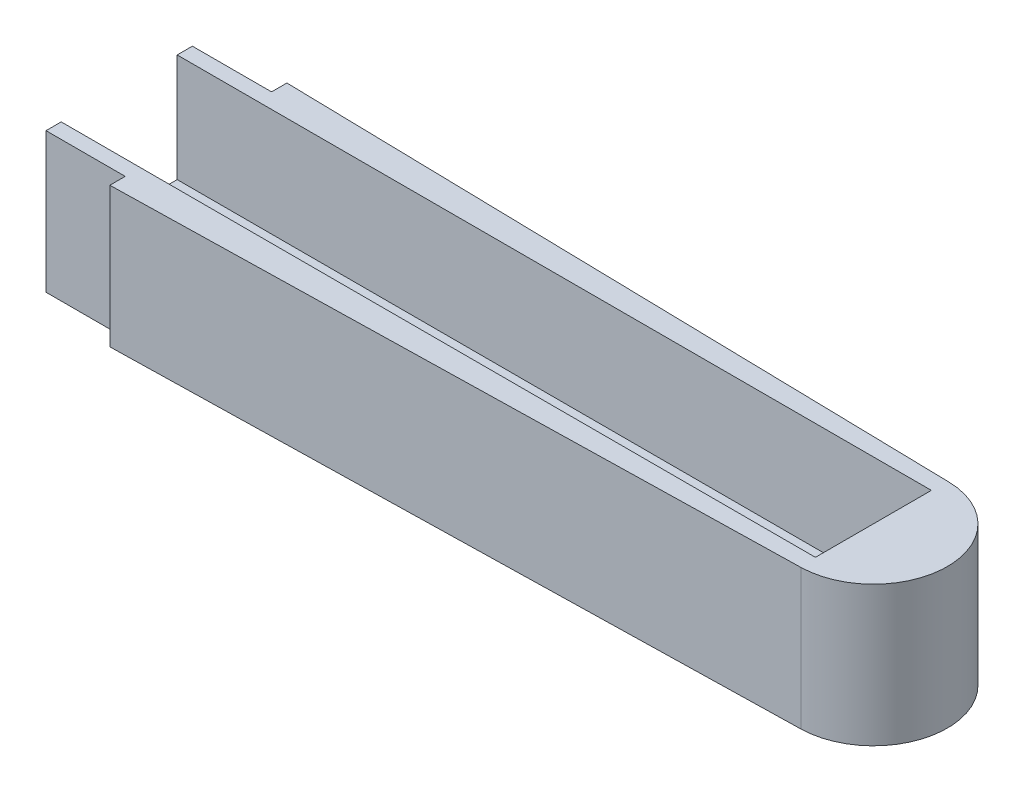
ISO-10303-21;
HEADER;
FILE_DESCRIPTION(('STEP AP214'),'2;1');
FILE_NAME('part.step','',(''),(''),'','','');
FILE_SCHEMA(('AUTOMOTIVE_DESIGN { 1 0 10303 214 1 1 1 1 }'));
ENDSEC;
DATA;
#1=APPLICATION_CONTEXT('core data for automotive mechanical design processes');
#2=APPLICATION_PROTOCOL_DEFINITION('international standard','automotive_design',2000,#1);
#3=PRODUCT_CONTEXT('',#1,'mechanical');
#4=PRODUCT('Part','Part','',(#3));
#5=PRODUCT_RELATED_PRODUCT_CATEGORY('part','',(#4));
#6=PRODUCT_DEFINITION_FORMATION('','',#4);
#7=PRODUCT_DEFINITION_CONTEXT('part definition',#1,'design');
#8=PRODUCT_DEFINITION('design','',#6,#7);
#9=PRODUCT_DEFINITION_SHAPE('','',#8);
#10=(LENGTH_UNIT() NAMED_UNIT(*) SI_UNIT(.MILLI.,.METRE.));
#11=(NAMED_UNIT(*) PLANE_ANGLE_UNIT() SI_UNIT($,.RADIAN.));
#12=(NAMED_UNIT(*) SI_UNIT($,.STERADIAN.) SOLID_ANGLE_UNIT());
#13=UNCERTAINTY_MEASURE_WITH_UNIT(LENGTH_MEASURE(1.E-05),#10,'distance_accuracy_value','');
#14=(GEOMETRIC_REPRESENTATION_CONTEXT(3) GLOBAL_UNCERTAINTY_ASSIGNED_CONTEXT((#13)) GLOBAL_UNIT_ASSIGNED_CONTEXT((#10,
#11,#12)) REPRESENTATION_CONTEXT('',''));
#15=CARTESIAN_POINT('',(0.,0.,0.));
#16=DIRECTION('',(0.,0.,1.));
#17=DIRECTION('',(1.,0.,0.));
#18=AXIS2_PLACEMENT_3D('',#15,#16,#17);
#19=CARTESIAN_POINT('',(267.,17.5,0.));
#20=DIRECTION('',(0.,-1.,0.));
#21=DIRECTION('',(0.,0.,-1.));
#22=AXIS2_PLACEMENT_3D('',#19,#20,#21);
#23=CYLINDRICAL_SURFACE('',#22,9.25);
#24=CARTESIAN_POINT('',(267.,0.,0.));
#25=DIRECTION('',(0.,1.,0.));
#26=DIRECTION('',(0.,0.,1.));
#27=AXIS2_PLACEMENT_3D('',#24,#25,#26);
#28=CIRCLE('',#27,9.25);
#29=CARTESIAN_POINT('',(267.19920411985,0.,9.24785476305909));
#30=VERTEX_POINT('',#29);
#31=CARTESIAN_POINT('',(267.19920411985,0.,-9.24785476305909));
#32=VERTEX_POINT('',#31);
#33=EDGE_CURVE('E245',#30,#32,#28,.T.);
#34=ORIENTED_EDGE('',*,*,#33,.T.);
#35=DIRECTION('',(0.,-1.,0.));
#36=VECTOR('',#35,1.);
#37=CARTESIAN_POINT('',(267.19920411985,17.5,-9.24785476305909));
#38=LINE('',#37,#36);
#39=CARTESIAN_POINT('',(267.19920411985,17.5,-9.24785476305909));
#40=VERTEX_POINT('',#39);
#41=EDGE_CURVE('E265',#40,#32,#38,.T.);
#42=ORIENTED_EDGE('',*,*,#41,.F.);
#43=CARTESIAN_POINT('',(267.,17.5,0.));
#44=DIRECTION('',(0.,1.,0.));
#45=DIRECTION('',(0.,0.,1.));
#46=AXIS2_PLACEMENT_3D('',#43,#44,#45);
#47=CIRCLE('',#46,9.25);
#48=CARTESIAN_POINT('',(267.19920411985,17.5,9.24785476305909));
#49=VERTEX_POINT('',#48);
#50=EDGE_CURVE('E247',#49,#40,#47,.T.);
#51=ORIENTED_EDGE('',*,*,#50,.F.);
#52=DIRECTION('',(0.,-1.,0.));
#53=VECTOR('',#52,1.);
#54=CARTESIAN_POINT('',(267.19920411985,17.5,9.24785476305909));
#55=LINE('',#54,#53);
#56=EDGE_CURVE('E256',#49,#30,#55,.T.);
#57=ORIENTED_EDGE('',*,*,#56,.T.);
#58=EDGE_LOOP('',(#34,#42,#51,#57));
#59=FACE_BOUND('',#58,.T.);
#60=ADVANCED_FACE('F33',(#59),#23,.T.);
#61=CARTESIAN_POINT('',(267.,2.,-7.25));
#62=DIRECTION('',(1.,0.,0.));
#63=DIRECTION('',(0.,0.,-1.));
#64=AXIS2_PLACEMENT_3D('',#61,#62,#63);
#65=PLANE('',#64);
#66=DIRECTION('',(0.,-1.,0.));
#67=VECTOR('',#66,1.);
#68=CARTESIAN_POINT('',(267.,4.,6.25));
#69=LINE('',#68,#67);
#70=CARTESIAN_POINT('',(267.,4.,6.25));
#71=VERTEX_POINT('',#70);
#72=CARTESIAN_POINT('',(267.,2.,6.25));
#73=VERTEX_POINT('',#72);
#74=EDGE_CURVE('E217',#71,#73,#69,.T.);
#75=ORIENTED_EDGE('',*,*,#74,.F.);
#76=DIRECTION('',(0.,0.,-1.));
#77=VECTOR('',#76,1.);
#78=CARTESIAN_POINT('',(267.,4.,7.25));
#79=LINE('',#78,#77);
#80=CARTESIAN_POINT('',(267.,4.,7.25));
#81=VERTEX_POINT('',#80);
#82=EDGE_CURVE('E209',#81,#71,#79,.T.);
#83=ORIENTED_EDGE('',*,*,#82,.F.);
#84=DIRECTION('',(0.,1.,0.));
#85=VECTOR('',#84,1.);
#86=CARTESIAN_POINT('',(267.,2.,7.25));
#87=LINE('',#86,#85);
#88=CARTESIAN_POINT('',(267.,17.5,7.25));
#89=VERTEX_POINT('',#88);
#90=EDGE_CURVE('E242',#81,#89,#87,.T.);
#91=ORIENTED_EDGE('',*,*,#90,.T.);
#92=DIRECTION('',(0.,0.,-1.));
#93=VECTOR('',#92,1.);
#94=CARTESIAN_POINT('',(267.,17.5,-7.25));
#95=LINE('',#94,#93);
#96=CARTESIAN_POINT('',(267.,17.5,-7.25));
#97=VERTEX_POINT('',#96);
#98=EDGE_CURVE('E233',#89,#97,#95,.T.);
#99=ORIENTED_EDGE('',*,*,#98,.T.);
#100=DIRECTION('',(0.,1.,0.));
#101=VECTOR('',#100,1.);
#102=CARTESIAN_POINT('',(267.,2.,-7.25));
#103=LINE('',#102,#101);
#104=CARTESIAN_POINT('',(267.,4.,-7.25));
#105=VERTEX_POINT('',#104);
#106=EDGE_CURVE('E55',#105,#97,#103,.T.);
#107=ORIENTED_EDGE('',*,*,#106,.F.);
#108=DIRECTION('',(0.,0.,-1.));
#109=VECTOR('',#108,1.);
#110=CARTESIAN_POINT('',(267.,4.,-7.25));
#111=LINE('',#110,#109);
#112=CARTESIAN_POINT('',(267.,4.,-6.25000000000001));
#113=VERTEX_POINT('',#112);
#114=EDGE_CURVE('E224',#113,#105,#111,.T.);
#115=ORIENTED_EDGE('',*,*,#114,.F.);
#116=DIRECTION('',(0.,-1.,0.));
#117=VECTOR('',#116,1.);
#118=CARTESIAN_POINT('',(267.,4.,-6.25000000000001));
#119=LINE('',#118,#117);
#120=CARTESIAN_POINT('',(267.,2.,-6.25000000000001));
#121=VERTEX_POINT('',#120);
#122=EDGE_CURVE('E229',#113,#121,#119,.T.);
#123=ORIENTED_EDGE('',*,*,#122,.T.);
#124=DIRECTION('',(0.,0.,-1.));
#125=VECTOR('',#124,1.);
#126=CARTESIAN_POINT('',(267.,2.,-7.25));
#127=LINE('',#126,#125);
#128=EDGE_CURVE('E234',#73,#121,#127,.T.);
#129=ORIENTED_EDGE('',*,*,#128,.F.);
#130=EDGE_LOOP('',(#75,#83,#91,#99,#107,#115,#123,#129));
#131=FACE_BOUND('',#130,.T.);
#132=ADVANCED_FACE('F278',(#131),#65,.F.);
#133=CARTESIAN_POINT('',(0.,4.,0.));
#134=DIRECTION('',(0.,1.,0.));
#135=DIRECTION('',(0.,0.,1.));
#136=AXIS2_PLACEMENT_3D('',#133,#134,#135);
#137=PLANE('',#136);
#138=DIRECTION('',(-1.,0.,0.));
#139=VECTOR('',#138,1.);
#140=CARTESIAN_POINT('',(267.,4.,6.25));
#141=LINE('',#140,#139);
#142=CARTESIAN_POINT('',(172.7,4.,6.25));
#143=VERTEX_POINT('',#142);
#144=EDGE_CURVE('E212',#71,#143,#141,.T.);
#145=ORIENTED_EDGE('',*,*,#144,.T.);
#146=DIRECTION('',(0.,0.,1.));
#147=VECTOR('',#146,1.);
#148=CARTESIAN_POINT('',(172.7,4.,0.));
#149=LINE('',#148,#147);
#150=CARTESIAN_POINT('',(172.7,4.,7.25000000000001));
#151=VERTEX_POINT('',#150);
#152=EDGE_CURVE('E40',#143,#151,#149,.T.);
#153=ORIENTED_EDGE('',*,*,#152,.T.);
#154=DIRECTION('',(1.,0.,0.));
#155=VECTOR('',#154,1.);
#156=CARTESIAN_POINT('',(267.,4.,7.25));
#157=LINE('',#156,#155);
#158=EDGE_CURVE('E215',#151,#81,#157,.T.);
#159=ORIENTED_EDGE('',*,*,#158,.T.);
#160=ORIENTED_EDGE('',*,*,#82,.T.);
#161=EDGE_LOOP('',(#145,#153,#159,#160));
#162=FACE_BOUND('',#161,.T.);
#163=ADVANCED_FACE('F269',(#162),#137,.T.);
#164=CARTESIAN_POINT('',(267.,4.,6.25));
#165=DIRECTION('',(0.,0.,1.));
#166=DIRECTION('',(1.,0.,0.));
#167=AXIS2_PLACEMENT_3D('',#164,#165,#166);
#168=PLANE('',#167);
#169=DIRECTION('',(0.,-1.,0.));
#170=VECTOR('',#169,1.);
#171=CARTESIAN_POINT('',(172.7,4.,6.25000000000001));
#172=LINE('',#171,#170);
#173=CARTESIAN_POINT('',(172.7,2.,6.25000000000001));
#174=VERTEX_POINT('',#173);
#175=EDGE_CURVE('E164',#143,#174,#172,.T.);
#176=ORIENTED_EDGE('',*,*,#175,.F.);
#177=ORIENTED_EDGE('',*,*,#144,.F.);
#178=ORIENTED_EDGE('',*,*,#74,.T.);
#179=DIRECTION('',(-1.,0.,0.));
#180=VECTOR('',#179,1.);
#181=CARTESIAN_POINT('',(267.,2.,6.25));
#182=LINE('',#181,#180);
#183=EDGE_CURVE('E208',#73,#174,#182,.T.);
#184=ORIENTED_EDGE('',*,*,#183,.T.);
#185=EDGE_LOOP('',(#176,#177,#178,#184));
#186=FACE_BOUND('',#185,.T.);
#187=ADVANCED_FACE('F298',(#186),#168,.F.);
#188=CARTESIAN_POINT('',(267.,17.5,0.));
#189=DIRECTION('',(0.,1.,0.));
#190=DIRECTION('',(0.,0.,1.));
#191=AXIS2_PLACEMENT_3D('',#188,#189,#190);
#192=PLANE('',#191);
#193=DIRECTION('',(-1.,0.,0.));
#194=VECTOR('',#193,1.);
#195=CARTESIAN_POINT('',(172.7,17.5,9.15000000000001));
#196=LINE('',#195,#194);
#197=CARTESIAN_POINT('',(182.6,17.5,9.15000000000001));
#198=VERTEX_POINT('',#197);
#199=CARTESIAN_POINT('',(172.7,17.5,9.15000000000001));
#200=VERTEX_POINT('',#199);
#201=EDGE_CURVE('E155',#198,#200,#196,.T.);
#202=ORIENTED_EDGE('',*,*,#201,.F.);
#203=DIRECTION('',(0.,0.,-1.));
#204=VECTOR('',#203,1.);
#205=CARTESIAN_POINT('',(182.6,17.5,9.15000000000001));
#206=LINE('',#205,#204);
#207=CARTESIAN_POINT('',(182.6,17.5,11.0701703625686));
#208=VERTEX_POINT('',#207);
#209=EDGE_CURVE('E145',#208,#198,#206,.T.);
#210=ORIENTED_EDGE('',*,*,#209,.F.);
#211=DIRECTION('',(0.999768082492875,0.,-0.0215355805243446));
#212=VECTOR('',#211,1.);
#213=CARTESIAN_POINT('',(267.19920411985,17.5,9.24785476305909));
#214=LINE('',#213,#212);
#215=EDGE_CURVE('E254',#208,#49,#214,.T.);
#216=ORIENTED_EDGE('',*,*,#215,.T.);
#217=ORIENTED_EDGE('',*,*,#50,.T.);
#218=DIRECTION('',(-0.999768082492875,0.,-0.0215355805243446));
#219=VECTOR('',#218,1.);
#220=CARTESIAN_POINT('',(0.323033707865168,17.5,-14.9965212373931));
#221=LINE('',#220,#219);
#222=CARTESIAN_POINT('',(182.6,17.5,-11.0701703625686));
#223=VERTEX_POINT('',#222);
#224=EDGE_CURVE('E250',#40,#223,#221,.T.);
#225=ORIENTED_EDGE('',*,*,#224,.T.);
#226=DIRECTION('',(0.,0.,-1.));
#227=VECTOR('',#226,1.);
#228=CARTESIAN_POINT('',(182.6,17.5,-9.15000000000001));
#229=LINE('',#228,#227);
#230=CARTESIAN_POINT('',(182.6,17.5,-9.15000000000001));
#231=VERTEX_POINT('',#230);
#232=EDGE_CURVE('E177',#231,#223,#229,.T.);
#233=ORIENTED_EDGE('',*,*,#232,.F.);
#234=DIRECTION('',(1.,0.,0.));
#235=VECTOR('',#234,1.);
#236=CARTESIAN_POINT('',(172.7,17.5,-9.15000000000001));
#237=LINE('',#236,#235);
#238=CARTESIAN_POINT('',(172.7,17.5,-9.15000000000001));
#239=VERTEX_POINT('',#238);
#240=EDGE_CURVE('E175',#239,#231,#237,.T.);
#241=ORIENTED_EDGE('',*,*,#240,.F.);
#242=DIRECTION('',(0.,0.,-1.));
#243=VECTOR('',#242,1.);
#244=CARTESIAN_POINT('',(172.7,17.5,9.15000000000001));
#245=LINE('',#244,#243);
#246=CARTESIAN_POINT('',(172.7,17.5,-7.25));
#247=VERTEX_POINT('',#246);
#248=EDGE_CURVE('E171',#247,#239,#245,.T.);
#249=ORIENTED_EDGE('',*,*,#248,.F.);
#250=DIRECTION('',(-1.,0.,0.));
#251=VECTOR('',#250,1.);
#252=CARTESIAN_POINT('',(15.,17.5,-7.25));
#253=LINE('',#252,#251);
#254=EDGE_CURVE('E239',#97,#247,#253,.T.);
#255=ORIENTED_EDGE('',*,*,#254,.F.);
#256=ORIENTED_EDGE('',*,*,#98,.F.);
#257=DIRECTION('',(1.,0.,0.));
#258=VECTOR('',#257,1.);
#259=CARTESIAN_POINT('',(15.,17.5,7.25));
#260=LINE('',#259,#258);
#261=CARTESIAN_POINT('',(172.7,17.5,7.25));
#262=VERTEX_POINT('',#261);
#263=EDGE_CURVE('E237',#262,#89,#260,.T.);
#264=ORIENTED_EDGE('',*,*,#263,.F.);
#265=EDGE_CURVE('E170',#200,#262,#245,.T.);
#266=ORIENTED_EDGE('',*,*,#265,.F.);
#267=EDGE_LOOP('',(#202,#210,#216,#217,#225,#233,#241,#249,#255,#256,#264,#266));
#268=FACE_BOUND('',#267,.T.);
#269=ADVANCED_FACE('F168',(#268),#192,.T.);
#270=CARTESIAN_POINT('',(267.,0.,0.));
#271=DIRECTION('',(0.,1.,0.));
#272=DIRECTION('',(0.,0.,1.));
#273=AXIS2_PLACEMENT_3D('',#270,#271,#272);
#274=PLANE('',#273);
#275=DIRECTION('',(0.,0.,1.));
#276=VECTOR('',#275,1.);
#277=CARTESIAN_POINT('',(182.6,0.,0.));
#278=LINE('',#277,#276);
#279=CARTESIAN_POINT('',(182.6,0.,9.15000000000001));
#280=VERTEX_POINT('',#279);
#281=CARTESIAN_POINT('',(182.6,0.,11.0701703625686));
#282=VERTEX_POINT('',#281);
#283=EDGE_CURVE('E11',#280,#282,#278,.T.);
#284=ORIENTED_EDGE('',*,*,#283,.F.);
#285=DIRECTION('',(-1.,0.,0.));
#286=VECTOR('',#285,1.);
#287=CARTESIAN_POINT('',(172.7,0.,9.15000000000001));
#288=LINE('',#287,#286);
#289=CARTESIAN_POINT('',(172.7,0.,9.15000000000001));
#290=VERTEX_POINT('',#289);
#291=EDGE_CURVE('E162',#280,#290,#288,.T.);
#292=ORIENTED_EDGE('',*,*,#291,.T.);
#293=DIRECTION('',(0.,0.,-1.));
#294=VECTOR('',#293,1.);
#295=CARTESIAN_POINT('',(172.7,0.,9.15000000000001));
#296=LINE('',#295,#294);
#297=CARTESIAN_POINT('',(172.7,0.,-9.15000000000001));
#298=VERTEX_POINT('',#297);
#299=EDGE_CURVE('E181',#290,#298,#296,.T.);
#300=ORIENTED_EDGE('',*,*,#299,.T.);
#301=DIRECTION('',(1.,0.,0.));
#302=VECTOR('',#301,1.);
#303=CARTESIAN_POINT('',(172.7,0.,-9.15000000000001));
#304=LINE('',#303,#302);
#305=CARTESIAN_POINT('',(182.6,0.,-9.15000000000001));
#306=VERTEX_POINT('',#305);
#307=EDGE_CURVE('E184',#298,#306,#304,.T.);
#308=ORIENTED_EDGE('',*,*,#307,.T.);
#309=DIRECTION('',(0.,0.,-1.));
#310=VECTOR('',#309,1.);
#311=CARTESIAN_POINT('',(182.6,0.,-9.15000000000001));
#312=LINE('',#311,#310);
#313=CARTESIAN_POINT('',(182.6,0.,-11.0701703625686));
#314=VERTEX_POINT('',#313);
#315=EDGE_CURVE('E156',#306,#314,#312,.T.);
#316=ORIENTED_EDGE('',*,*,#315,.T.);
#317=DIRECTION('',(-0.999768082492875,0.,-0.0215355805243446));
#318=VECTOR('',#317,1.);
#319=CARTESIAN_POINT('',(0.323033707865168,0.,-14.9965212373931));
#320=LINE('',#319,#318);
#321=EDGE_CURVE('E259',#32,#314,#320,.T.);
#322=ORIENTED_EDGE('',*,*,#321,.F.);
#323=ORIENTED_EDGE('',*,*,#33,.F.);
#324=DIRECTION('',(0.999768082492875,0.,-0.0215355805243446));
#325=VECTOR('',#324,1.);
#326=CARTESIAN_POINT('',(267.19920411985,0.,9.24785476305909));
#327=LINE('',#326,#325);
#328=EDGE_CURVE('E251',#282,#30,#327,.T.);
#329=ORIENTED_EDGE('',*,*,#328,.F.);
#330=EDGE_LOOP('',(#284,#292,#300,#308,#316,#322,#323,#329));
#331=FACE_BOUND('',#330,.T.);
#332=ADVANCED_FACE('F325',(#331),#274,.F.);
#333=CARTESIAN_POINT('',(267.19920411985,17.5,9.24785476305909));
#334=DIRECTION('',(-0.0215355805243446,0.,-0.999768082492875));
#335=DIRECTION('',(-0.999768082492875,0.,0.0215355805243446));
#336=AXIS2_PLACEMENT_3D('',#333,#334,#335);
#337=PLANE('',#336);
#338=DIRECTION('',(0.,1.,0.));
#339=VECTOR('',#338,1.);
#340=CARTESIAN_POINT('',(182.6,17.5,11.0701703625686));
#341=LINE('',#340,#339);
#342=EDGE_CURVE('E151',#282,#208,#341,.T.);
#343=ORIENTED_EDGE('',*,*,#342,.F.);
#344=ORIENTED_EDGE('',*,*,#328,.T.);
#345=ORIENTED_EDGE('',*,*,#56,.F.);
#346=ORIENTED_EDGE('',*,*,#215,.F.);
#347=EDGE_LOOP('',(#343,#344,#345,#346));
#348=FACE_BOUND('',#347,.T.);
#349=ADVANCED_FACE('F332',(#348),#337,.F.);
#350=CARTESIAN_POINT('',(0.323033707865168,17.5,-14.9965212373931));
#351=DIRECTION('',(-0.0215355805243446,0.,0.999768082492875));
#352=DIRECTION('',(0.999768082492875,0.,0.0215355805243446));
#353=AXIS2_PLACEMENT_3D('',#350,#351,#352);
#354=PLANE('',#353);
#355=DIRECTION('',(0.,-1.,0.));
#356=VECTOR('',#355,1.);
#357=CARTESIAN_POINT('',(182.6,17.5,-11.0701703625686));
#358=LINE('',#357,#356);
#359=EDGE_CURVE('E205',#223,#314,#358,.T.);
#360=ORIENTED_EDGE('',*,*,#359,.F.);
#361=ORIENTED_EDGE('',*,*,#224,.F.);
#362=ORIENTED_EDGE('',*,*,#41,.T.);
#363=ORIENTED_EDGE('',*,*,#321,.T.);
#364=EDGE_LOOP('',(#360,#361,#362,#363));
#365=FACE_BOUND('',#364,.T.);
#366=ADVANCED_FACE('F329',(#365),#354,.F.);
#367=CARTESIAN_POINT('',(0.,4.,0.));
#368=DIRECTION('',(0.,1.,0.));
#369=DIRECTION('',(0.,0.,1.));
#370=AXIS2_PLACEMENT_3D('',#367,#368,#369);
#371=PLANE('',#370);
#372=DIRECTION('',(-1.,0.,0.));
#373=VECTOR('',#372,1.);
#374=CARTESIAN_POINT('',(15.,4.,-7.25));
#375=LINE('',#374,#373);
#376=CARTESIAN_POINT('',(172.7,4.,-7.25));
#377=VERTEX_POINT('',#376);
#378=EDGE_CURVE('E226',#105,#377,#375,.T.);
#379=ORIENTED_EDGE('',*,*,#378,.T.);
#380=DIRECTION('',(0.,0.,1.));
#381=VECTOR('',#380,1.);
#382=CARTESIAN_POINT('',(172.7,4.,0.));
#383=LINE('',#382,#381);
#384=CARTESIAN_POINT('',(172.7,4.,-6.25000000000001));
#385=VERTEX_POINT('',#384);
#386=EDGE_CURVE('E200',#377,#385,#383,.T.);
#387=ORIENTED_EDGE('',*,*,#386,.T.);
#388=DIRECTION('',(1.,0.,0.));
#389=VECTOR('',#388,1.);
#390=CARTESIAN_POINT('',(15.,4.,-6.25));
#391=LINE('',#390,#389);
#392=EDGE_CURVE('E222',#385,#113,#391,.T.);
#393=ORIENTED_EDGE('',*,*,#392,.T.);
#394=ORIENTED_EDGE('',*,*,#114,.T.);
#395=EDGE_LOOP('',(#379,#387,#393,#394));
#396=FACE_BOUND('',#395,.T.);
#397=ADVANCED_FACE('F285',(#396),#371,.T.);
#398=CARTESIAN_POINT('',(15.,4.,-6.25));
#399=DIRECTION('',(0.,0.,-1.));
#400=DIRECTION('',(-1.,0.,0.));
#401=AXIS2_PLACEMENT_3D('',#398,#399,#400);
#402=PLANE('',#401);
#403=DIRECTION('',(0.,1.,0.));
#404=VECTOR('',#403,1.);
#405=CARTESIAN_POINT('',(172.7,4.,-6.25000000000001));
#406=LINE('',#405,#404);
#407=CARTESIAN_POINT('',(172.7,2.,-6.25000000000001));
#408=VERTEX_POINT('',#407);
#409=EDGE_CURVE('E198',#408,#385,#406,.T.);
#410=ORIENTED_EDGE('',*,*,#409,.F.);
#411=DIRECTION('',(1.,0.,0.));
#412=VECTOR('',#411,1.);
#413=CARTESIAN_POINT('',(15.,2.,-6.25));
#414=LINE('',#413,#412);
#415=EDGE_CURVE('E221',#408,#121,#414,.T.);
#416=ORIENTED_EDGE('',*,*,#415,.T.);
#417=ORIENTED_EDGE('',*,*,#122,.F.);
#418=ORIENTED_EDGE('',*,*,#392,.F.);
#419=EDGE_LOOP('',(#410,#416,#417,#418));
#420=FACE_BOUND('',#419,.T.);
#421=ADVANCED_FACE('F292',(#420),#402,.F.);
#422=CARTESIAN_POINT('',(15.,2.,-7.25));
#423=DIRECTION('',(0.,0.,-1.));
#424=DIRECTION('',(-1.,0.,0.));
#425=AXIS2_PLACEMENT_3D('',#422,#423,#424);
#426=PLANE('',#425);
#427=DIRECTION('',(0.,1.,0.));
#428=VECTOR('',#427,1.);
#429=CARTESIAN_POINT('',(172.7,2.,-7.25));
#430=LINE('',#429,#428);
#431=EDGE_CURVE('E203',#377,#247,#430,.T.);
#432=ORIENTED_EDGE('',*,*,#431,.F.);
#433=ORIENTED_EDGE('',*,*,#378,.F.);
#434=ORIENTED_EDGE('',*,*,#106,.T.);
#435=ORIENTED_EDGE('',*,*,#254,.T.);
#436=EDGE_LOOP('',(#432,#433,#434,#435));
#437=FACE_BOUND('',#436,.T.);
#438=ADVANCED_FACE('F283',(#437),#426,.F.);
#439=CARTESIAN_POINT('',(15.,2.,7.25));
#440=DIRECTION('',(0.,0.,1.));
#441=DIRECTION('',(1.,0.,0.));
#442=AXIS2_PLACEMENT_3D('',#439,#440,#441);
#443=PLANE('',#442);
#444=DIRECTION('',(0.,-1.,0.));
#445=VECTOR('',#444,1.);
#446=CARTESIAN_POINT('',(172.7,2.,7.25));
#447=LINE('',#446,#445);
#448=EDGE_CURVE('E47',#262,#151,#447,.T.);
#449=ORIENTED_EDGE('',*,*,#448,.F.);
#450=ORIENTED_EDGE('',*,*,#263,.T.);
#451=ORIENTED_EDGE('',*,*,#90,.F.);
#452=ORIENTED_EDGE('',*,*,#158,.F.);
#453=EDGE_LOOP('',(#449,#450,#451,#452));
#454=FACE_BOUND('',#453,.T.);
#455=ADVANCED_FACE('F274',(#454),#443,.F.);
#456=CARTESIAN_POINT('',(0.,2.,0.));
#457=DIRECTION('',(0.,1.,0.));
#458=DIRECTION('',(0.,0.,1.));
#459=AXIS2_PLACEMENT_3D('',#456,#457,#458);
#460=PLANE('',#459);
#461=ORIENTED_EDGE('',*,*,#415,.F.);
#462=DIRECTION('',(0.,0.,1.));
#463=VECTOR('',#462,1.);
#464=CARTESIAN_POINT('',(172.7,2.,0.));
#465=LINE('',#464,#463);
#466=EDGE_CURVE('E195',#408,#174,#465,.T.);
#467=ORIENTED_EDGE('',*,*,#466,.T.);
#468=ORIENTED_EDGE('',*,*,#183,.F.);
#469=ORIENTED_EDGE('',*,*,#128,.T.);
#470=EDGE_LOOP('',(#461,#467,#468,#469));
#471=FACE_BOUND('',#470,.T.);
#472=ADVANCED_FACE('F296',(#471),#460,.T.);
#473=CARTESIAN_POINT('',(172.7,17.5,9.15000000000001));
#474=DIRECTION('',(-1.,0.,0.));
#475=DIRECTION('',(0.,0.,1.));
#476=AXIS2_PLACEMENT_3D('',#473,#474,#475);
#477=PLANE('',#476);
#478=ORIENTED_EDGE('',*,*,#431,.T.);
#479=ORIENTED_EDGE('',*,*,#248,.T.);
#480=DIRECTION('',(0.,-1.,0.));
#481=VECTOR('',#480,1.);
#482=CARTESIAN_POINT('',(172.7,17.5,-9.15000000000001));
#483=LINE('',#482,#481);
#484=EDGE_CURVE('E190',#239,#298,#483,.T.);
#485=ORIENTED_EDGE('',*,*,#484,.T.);
#486=ORIENTED_EDGE('',*,*,#299,.F.);
#487=DIRECTION('',(0.,-1.,0.));
#488=VECTOR('',#487,1.);
#489=CARTESIAN_POINT('',(172.7,17.5,9.15000000000001));
#490=LINE('',#489,#488);
#491=EDGE_CURVE('E165',#200,#290,#490,.T.);
#492=ORIENTED_EDGE('',*,*,#491,.F.);
#493=ORIENTED_EDGE('',*,*,#265,.T.);
#494=ORIENTED_EDGE('',*,*,#448,.T.);
#495=ORIENTED_EDGE('',*,*,#152,.F.);
#496=ORIENTED_EDGE('',*,*,#175,.T.);
#497=ORIENTED_EDGE('',*,*,#466,.F.);
#498=ORIENTED_EDGE('',*,*,#409,.T.);
#499=ORIENTED_EDGE('',*,*,#386,.F.);
#500=EDGE_LOOP('',(#478,#479,#485,#486,#492,#493,#494,#495,#496,#497,#498,#499));
#501=FACE_BOUND('',#500,.T.);
#502=ADVANCED_FACE('F299',(#501),#477,.T.);
#503=CARTESIAN_POINT('',(182.6,17.5,-9.15000000000001));
#504=DIRECTION('',(-1.,0.,0.));
#505=DIRECTION('',(0.,0.,1.));
#506=AXIS2_PLACEMENT_3D('',#503,#504,#505);
#507=PLANE('',#506);
#508=ORIENTED_EDGE('',*,*,#359,.T.);
#509=ORIENTED_EDGE('',*,*,#315,.F.);
#510=DIRECTION('',(0.,-1.,0.));
#511=VECTOR('',#510,1.);
#512=CARTESIAN_POINT('',(182.6,17.5,-9.15000000000001));
#513=LINE('',#512,#511);
#514=EDGE_CURVE('E179',#231,#306,#513,.T.);
#515=ORIENTED_EDGE('',*,*,#514,.F.);
#516=ORIENTED_EDGE('',*,*,#232,.T.);
#517=EDGE_LOOP('',(#508,#509,#515,#516));
#518=FACE_BOUND('',#517,.T.);
#519=ADVANCED_FACE('F301',(#518),#507,.T.);
#520=CARTESIAN_POINT('',(172.7,17.5,-9.15000000000001));
#521=DIRECTION('',(0.,0.,-1.));
#522=DIRECTION('',(-1.,0.,0.));
#523=AXIS2_PLACEMENT_3D('',#520,#521,#522);
#524=PLANE('',#523);
#525=ORIENTED_EDGE('',*,*,#307,.F.);
#526=ORIENTED_EDGE('',*,*,#484,.F.);
#527=ORIENTED_EDGE('',*,*,#240,.T.);
#528=ORIENTED_EDGE('',*,*,#514,.T.);
#529=EDGE_LOOP('',(#525,#526,#527,#528));
#530=FACE_BOUND('',#529,.T.);
#531=ADVANCED_FACE('F307',(#530),#524,.T.);
#532=CARTESIAN_POINT('',(172.7,17.5,9.15000000000001));
#533=DIRECTION('',(0.,0.,1.));
#534=DIRECTION('',(1.,0.,0.));
#535=AXIS2_PLACEMENT_3D('',#532,#533,#534);
#536=PLANE('',#535);
#537=ORIENTED_EDGE('',*,*,#291,.F.);
#538=DIRECTION('',(0.,-1.,0.));
#539=VECTOR('',#538,1.);
#540=CARTESIAN_POINT('',(182.6,17.5,9.15000000000001));
#541=LINE('',#540,#539);
#542=EDGE_CURVE('E148',#198,#280,#541,.T.);
#543=ORIENTED_EDGE('',*,*,#542,.F.);
#544=ORIENTED_EDGE('',*,*,#201,.T.);
#545=ORIENTED_EDGE('',*,*,#491,.T.);
#546=EDGE_LOOP('',(#537,#543,#544,#545));
#547=FACE_BOUND('',#546,.T.);
#548=ADVANCED_FACE('F159',(#547),#536,.T.);
#549=CARTESIAN_POINT('',(182.6,17.5,9.15000000000001));
#550=DIRECTION('',(-1.,0.,0.));
#551=DIRECTION('',(0.,0.,1.));
#552=AXIS2_PLACEMENT_3D('',#549,#550,#551);
#553=PLANE('',#552);
#554=ORIENTED_EDGE('',*,*,#342,.T.);
#555=ORIENTED_EDGE('',*,*,#209,.T.);
#556=ORIENTED_EDGE('',*,*,#542,.T.);
#557=ORIENTED_EDGE('',*,*,#283,.T.);
#558=EDGE_LOOP('',(#554,#555,#556,#557));
#559=FACE_BOUND('',#558,.T.);
#560=ADVANCED_FACE('F147',(#559),#553,.T.);
#561=CLOSED_SHELL('',(#60,#132,#163,#187,#269,#332,#349,#366,#397,#421,#438,#455,#472,#502,#519,
#531,#548,#560));
#562=MANIFOLD_SOLID_BREP('B2',#561);
#563=ADVANCED_BREP_SHAPE_REPRESENTATION('',(#18,#562),#14);
#564=SHAPE_DEFINITION_REPRESENTATION(#9,#563);
ENDSEC;
END-ISO-10303-21;
